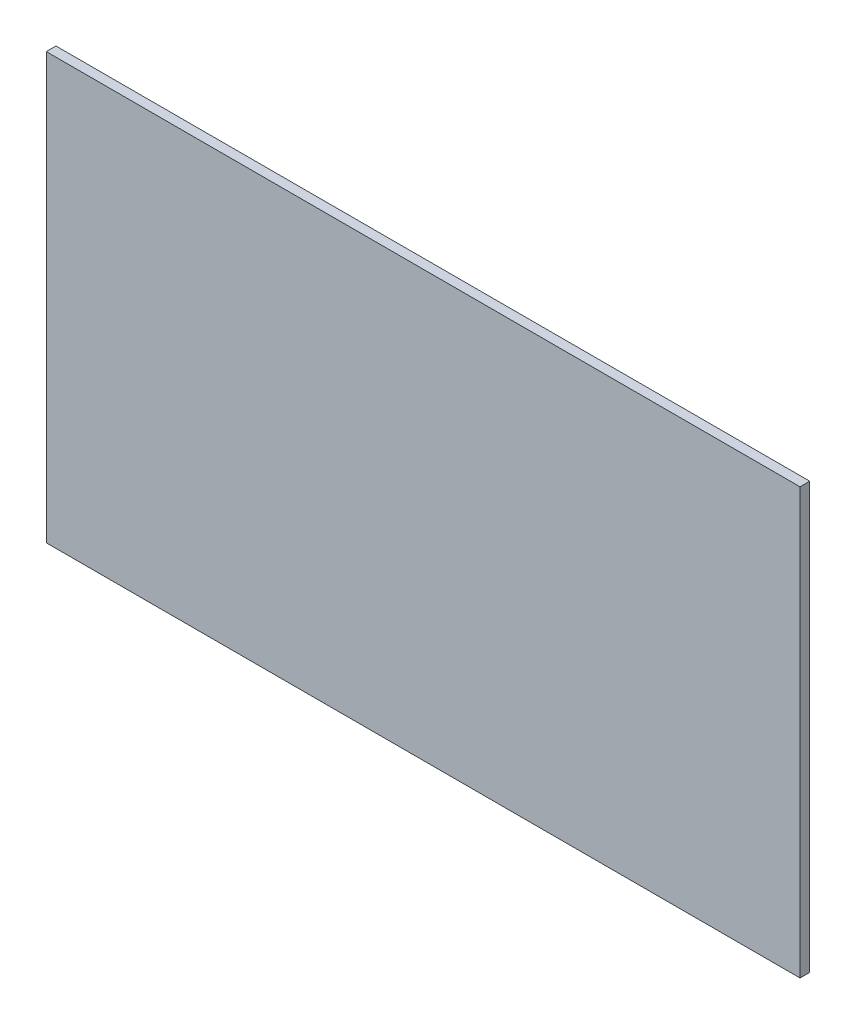
ISO-10303-21;
HEADER;
FILE_DESCRIPTION(('STEP AP214'),'2;1');
FILE_NAME('part.step','',(''),(''),'','','');
FILE_SCHEMA(('AUTOMOTIVE_DESIGN { 1 0 10303 214 1 1 1 1 }'));
ENDSEC;
DATA;
#1=APPLICATION_CONTEXT('core data for automotive mechanical design processes');
#2=APPLICATION_PROTOCOL_DEFINITION('international standard','automotive_design',2000,#1);
#3=PRODUCT_CONTEXT('',#1,'mechanical');
#4=PRODUCT('Part','Part','',(#3));
#5=PRODUCT_RELATED_PRODUCT_CATEGORY('part','',(#4));
#6=PRODUCT_DEFINITION_FORMATION('','',#4);
#7=PRODUCT_DEFINITION_CONTEXT('part definition',#1,'design');
#8=PRODUCT_DEFINITION('design','',#6,#7);
#9=PRODUCT_DEFINITION_SHAPE('','',#8);
#10=(LENGTH_UNIT() NAMED_UNIT(*) SI_UNIT(.MILLI.,.METRE.));
#11=(NAMED_UNIT(*) PLANE_ANGLE_UNIT() SI_UNIT($,.RADIAN.));
#12=(NAMED_UNIT(*) SI_UNIT($,.STERADIAN.) SOLID_ANGLE_UNIT());
#13=UNCERTAINTY_MEASURE_WITH_UNIT(LENGTH_MEASURE(1.E-05),#10,'distance_accuracy_value','');
#14=(GEOMETRIC_REPRESENTATION_CONTEXT(3) GLOBAL_UNCERTAINTY_ASSIGNED_CONTEXT((#13)) GLOBAL_UNIT_ASSIGNED_CONTEXT((#10,
#11,#12)) REPRESENTATION_CONTEXT('',''));
#15=CARTESIAN_POINT('',(0.,0.,0.));
#16=DIRECTION('',(0.,0.,1.));
#17=DIRECTION('',(1.,0.,0.));
#18=AXIS2_PLACEMENT_3D('',#15,#16,#17);
#19=CARTESIAN_POINT('',(0.,0.,3.));
#20=DIRECTION('',(1.,0.,0.));
#21=DIRECTION('',(0.,1.,0.));
#22=AXIS2_PLACEMENT_3D('',#19,#20,#21);
#23=PLANE('',#22);
#24=DIRECTION('',(0.,-1.,0.));
#25=VECTOR('',#24,1.);
#26=CARTESIAN_POINT('',(0.,0.,0.));
#27=LINE('',#26,#25);
#28=CARTESIAN_POINT('',(0.,0.,0.));
#29=VERTEX_POINT('',#28);
#30=CARTESIAN_POINT('',(0.,-131.5,0.));
#31=VERTEX_POINT('',#30);
#32=EDGE_CURVE('E96',#29,#31,#27,.T.);
#33=ORIENTED_EDGE('',*,*,#32,.T.);
#34=DIRECTION('',(0.,0.,-1.));
#35=VECTOR('',#34,1.);
#36=CARTESIAN_POINT('',(0.,-131.5,3.));
#37=LINE('',#36,#35);
#38=CARTESIAN_POINT('',(0.,-131.5,3.));
#39=VERTEX_POINT('',#38);
#40=EDGE_CURVE('E11',#39,#31,#37,.T.);
#41=ORIENTED_EDGE('',*,*,#40,.F.);
#42=DIRECTION('',(0.,-1.,0.));
#43=VECTOR('',#42,1.);
#44=CARTESIAN_POINT('',(0.,0.,3.));
#45=LINE('',#44,#43);
#46=CARTESIAN_POINT('',(0.,0.,3.));
#47=VERTEX_POINT('',#46);
#48=EDGE_CURVE('E84',#47,#39,#45,.T.);
#49=ORIENTED_EDGE('',*,*,#48,.F.);
#50=DIRECTION('',(0.,0.,-1.));
#51=VECTOR('',#50,1.);
#52=CARTESIAN_POINT('',(0.,0.,3.));
#53=LINE('',#52,#51);
#54=EDGE_CURVE('E92',#47,#29,#53,.T.);
#55=ORIENTED_EDGE('',*,*,#54,.T.);
#56=EDGE_LOOP('',(#33,#41,#49,#55));
#57=FACE_BOUND('',#56,.T.);
#58=ADVANCED_FACE('F33',(#57),#23,.F.);
#59=CARTESIAN_POINT('',(0.,-131.5,3.));
#60=DIRECTION('',(0.,1.,0.));
#61=DIRECTION('',(0.,0.,1.));
#62=AXIS2_PLACEMENT_3D('',#59,#60,#61);
#63=PLANE('',#62);
#64=DIRECTION('',(1.,0.,0.));
#65=VECTOR('',#64,1.);
#66=CARTESIAN_POINT('',(0.,-131.5,0.));
#67=LINE('',#66,#65);
#68=CARTESIAN_POINT('',(233.,-131.5,0.));
#69=VERTEX_POINT('',#68);
#70=EDGE_CURVE('E88',#31,#69,#67,.T.);
#71=ORIENTED_EDGE('',*,*,#70,.T.);
#72=DIRECTION('',(0.,0.,-1.));
#73=VECTOR('',#72,1.);
#74=CARTESIAN_POINT('',(233.,-131.5,3.));
#75=LINE('',#74,#73);
#76=CARTESIAN_POINT('',(233.,-131.5,3.));
#77=VERTEX_POINT('',#76);
#78=EDGE_CURVE('E41',#77,#69,#75,.T.);
#79=ORIENTED_EDGE('',*,*,#78,.F.);
#80=DIRECTION('',(1.,0.,0.));
#81=VECTOR('',#80,1.);
#82=CARTESIAN_POINT('',(0.,-131.5,3.));
#83=LINE('',#82,#81);
#84=EDGE_CURVE('E79',#39,#77,#83,.T.);
#85=ORIENTED_EDGE('',*,*,#84,.F.);
#86=ORIENTED_EDGE('',*,*,#40,.T.);
#87=EDGE_LOOP('',(#71,#79,#85,#86));
#88=FACE_BOUND('',#87,.T.);
#89=ADVANCED_FACE('F87',(#88),#63,.F.);
#90=CARTESIAN_POINT('',(233.,0.,3.));
#91=DIRECTION('',(-1.,0.,0.));
#92=DIRECTION('',(0.,-1.,0.));
#93=AXIS2_PLACEMENT_3D('',#90,#91,#92);
#94=PLANE('',#93);
#95=DIRECTION('',(0.,1.,0.));
#96=VECTOR('',#95,1.);
#97=CARTESIAN_POINT('',(233.,0.,0.));
#98=LINE('',#97,#96);
#99=CARTESIAN_POINT('',(233.,0.,0.));
#100=VERTEX_POINT('',#99);
#101=EDGE_CURVE('E66',#69,#100,#98,.T.);
#102=ORIENTED_EDGE('',*,*,#101,.T.);
#103=DIRECTION('',(0.,0.,-1.));
#104=VECTOR('',#103,1.);
#105=CARTESIAN_POINT('',(233.,0.,3.));
#106=LINE('',#105,#104);
#107=CARTESIAN_POINT('',(233.,0.,3.));
#108=VERTEX_POINT('',#107);
#109=EDGE_CURVE('E89',#108,#100,#106,.T.);
#110=ORIENTED_EDGE('',*,*,#109,.F.);
#111=DIRECTION('',(0.,1.,0.));
#112=VECTOR('',#111,1.);
#113=CARTESIAN_POINT('',(233.,0.,3.));
#114=LINE('',#113,#112);
#115=EDGE_CURVE('E82',#77,#108,#114,.T.);
#116=ORIENTED_EDGE('',*,*,#115,.F.);
#117=ORIENTED_EDGE('',*,*,#78,.T.);
#118=EDGE_LOOP('',(#102,#110,#116,#117));
#119=FACE_BOUND('',#118,.T.);
#120=ADVANCED_FACE('F90',(#119),#94,.F.);
#121=CARTESIAN_POINT('',(0.,0.,3.));
#122=DIRECTION('',(0.,-1.,0.));
#123=DIRECTION('',(0.,0.,-1.));
#124=AXIS2_PLACEMENT_3D('',#121,#122,#123);
#125=PLANE('',#124);
#126=DIRECTION('',(-1.,0.,0.));
#127=VECTOR('',#126,1.);
#128=CARTESIAN_POINT('',(0.,0.,0.));
#129=LINE('',#128,#127);
#130=EDGE_CURVE('E72',#100,#29,#129,.T.);
#131=ORIENTED_EDGE('',*,*,#130,.T.);
#132=ORIENTED_EDGE('',*,*,#54,.F.);
#133=DIRECTION('',(-1.,0.,0.));
#134=VECTOR('',#133,1.);
#135=CARTESIAN_POINT('',(0.,0.,3.));
#136=LINE('',#135,#134);
#137=EDGE_CURVE('E49',#108,#47,#136,.T.);
#138=ORIENTED_EDGE('',*,*,#137,.F.);
#139=ORIENTED_EDGE('',*,*,#109,.T.);
#140=EDGE_LOOP('',(#131,#132,#138,#139));
#141=FACE_BOUND('',#140,.T.);
#142=ADVANCED_FACE('F103',(#141),#125,.F.);
#143=CARTESIAN_POINT('',(0.,0.,3.));
#144=DIRECTION('',(0.,0.,1.));
#145=DIRECTION('',(1.,0.,0.));
#146=AXIS2_PLACEMENT_3D('',#143,#144,#145);
#147=PLANE('',#146);
#148=ORIENTED_EDGE('',*,*,#48,.T.);
#149=ORIENTED_EDGE('',*,*,#84,.T.);
#150=ORIENTED_EDGE('',*,*,#115,.T.);
#151=ORIENTED_EDGE('',*,*,#137,.T.);
#152=EDGE_LOOP('',(#148,#149,#150,#151));
#153=FACE_BOUND('',#152,.T.);
#154=ADVANCED_FACE('F80',(#153),#147,.T.);
#155=CARTESIAN_POINT('',(0.,0.,0.));
#156=DIRECTION('',(0.,0.,1.));
#157=DIRECTION('',(1.,0.,0.));
#158=AXIS2_PLACEMENT_3D('',#155,#156,#157);
#159=PLANE('',#158);
#160=ORIENTED_EDGE('',*,*,#32,.F.);
#161=ORIENTED_EDGE('',*,*,#130,.F.);
#162=ORIENTED_EDGE('',*,*,#101,.F.);
#163=ORIENTED_EDGE('',*,*,#70,.F.);
#164=EDGE_LOOP('',(#160,#161,#162,#163));
#165=FACE_BOUND('',#164,.T.);
#166=ADVANCED_FACE('F106',(#165),#159,.F.);
#167=CLOSED_SHELL('',(#58,#89,#120,#142,#154,#166));
#168=MANIFOLD_SOLID_BREP('B2',#167);
#169=ADVANCED_BREP_SHAPE_REPRESENTATION('',(#18,#168),#14);
#170=SHAPE_DEFINITION_REPRESENTATION(#9,#169);
ENDSEC;
END-ISO-10303-21;
